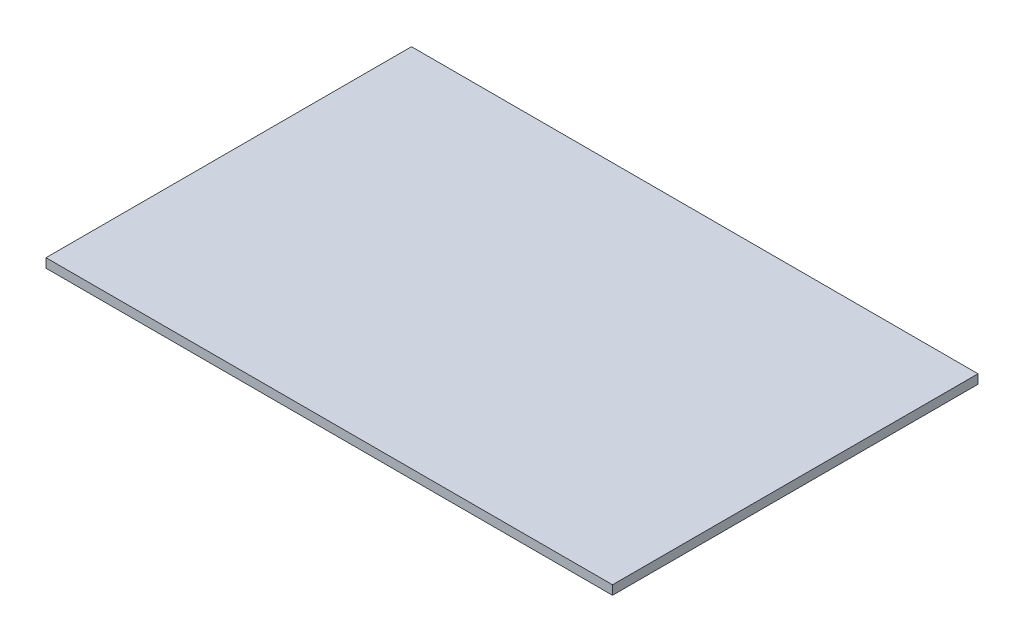
ISO-10303-21;
HEADER;
FILE_DESCRIPTION(('STEP AP214'),'2;1');
FILE_NAME('part.step','',(''),(''),'','','');
FILE_SCHEMA(('AUTOMOTIVE_DESIGN { 1 0 10303 214 1 1 1 1 }'));
ENDSEC;
DATA;
#1=APPLICATION_CONTEXT('core data for automotive mechanical design processes');
#2=APPLICATION_PROTOCOL_DEFINITION('international standard','automotive_design',2000,#1);
#3=PRODUCT_CONTEXT('',#1,'mechanical');
#4=PRODUCT('Part','Part','',(#3));
#5=PRODUCT_RELATED_PRODUCT_CATEGORY('part','',(#4));
#6=PRODUCT_DEFINITION_FORMATION('','',#4);
#7=PRODUCT_DEFINITION_CONTEXT('part definition',#1,'design');
#8=PRODUCT_DEFINITION('design','',#6,#7);
#9=PRODUCT_DEFINITION_SHAPE('','',#8);
#10=(LENGTH_UNIT() NAMED_UNIT(*) SI_UNIT(.MILLI.,.METRE.));
#11=(NAMED_UNIT(*) PLANE_ANGLE_UNIT() SI_UNIT($,.RADIAN.));
#12=(NAMED_UNIT(*) SI_UNIT($,.STERADIAN.) SOLID_ANGLE_UNIT());
#13=UNCERTAINTY_MEASURE_WITH_UNIT(LENGTH_MEASURE(1.E-05),#10,'distance_accuracy_value','');
#14=(GEOMETRIC_REPRESENTATION_CONTEXT(3) GLOBAL_UNCERTAINTY_ASSIGNED_CONTEXT((#13)) GLOBAL_UNIT_ASSIGNED_CONTEXT((#10,
#11,#12)) REPRESENTATION_CONTEXT('',''));
#15=CARTESIAN_POINT('',(0.,0.,0.));
#16=DIRECTION('',(0.,0.,1.));
#17=DIRECTION('',(1.,0.,0.));
#18=AXIS2_PLACEMENT_3D('',#15,#16,#17);
#19=CARTESIAN_POINT('',(-196.85,6.35,-254.));
#20=DIRECTION('',(1.,0.,0.));
#21=DIRECTION('',(0.,0.,-1.));
#22=AXIS2_PLACEMENT_3D('',#19,#20,#21);
#23=PLANE('',#22);
#24=DIRECTION('',(0.,0.,1.));
#25=VECTOR('',#24,1.);
#26=CARTESIAN_POINT('',(-196.85,0.,-254.));
#27=LINE('',#26,#25);
#28=CARTESIAN_POINT('',(-196.85,0.,-254.));
#29=VERTEX_POINT('',#28);
#30=CARTESIAN_POINT('',(-196.85,0.,0.));
#31=VERTEX_POINT('',#30);
#32=EDGE_CURVE('E96',#29,#31,#27,.T.);
#33=ORIENTED_EDGE('',*,*,#32,.T.);
#34=DIRECTION('',(0.,-1.,0.));
#35=VECTOR('',#34,1.);
#36=CARTESIAN_POINT('',(-196.85,6.35,0.));
#37=LINE('',#36,#35);
#38=CARTESIAN_POINT('',(-196.85,6.35,0.));
#39=VERTEX_POINT('',#38);
#40=EDGE_CURVE('E11',#39,#31,#37,.T.);
#41=ORIENTED_EDGE('',*,*,#40,.F.);
#42=DIRECTION('',(0.,0.,1.));
#43=VECTOR('',#42,1.);
#44=CARTESIAN_POINT('',(-196.85,6.35,-254.));
#45=LINE('',#44,#43);
#46=CARTESIAN_POINT('',(-196.85,6.35,-254.));
#47=VERTEX_POINT('',#46);
#48=EDGE_CURVE('E84',#47,#39,#45,.T.);
#49=ORIENTED_EDGE('',*,*,#48,.F.);
#50=DIRECTION('',(0.,-1.,0.));
#51=VECTOR('',#50,1.);
#52=CARTESIAN_POINT('',(-196.85,6.35,-254.));
#53=LINE('',#52,#51);
#54=EDGE_CURVE('E92',#47,#29,#53,.T.);
#55=ORIENTED_EDGE('',*,*,#54,.T.);
#56=EDGE_LOOP('',(#33,#41,#49,#55));
#57=FACE_BOUND('',#56,.T.);
#58=ADVANCED_FACE('F33',(#57),#23,.F.);
#59=CARTESIAN_POINT('',(-196.85,6.35,0.));
#60=DIRECTION('',(0.,0.,-1.));
#61=DIRECTION('',(-1.,0.,0.));
#62=AXIS2_PLACEMENT_3D('',#59,#60,#61);
#63=PLANE('',#62);
#64=DIRECTION('',(1.,0.,0.));
#65=VECTOR('',#64,1.);
#66=CARTESIAN_POINT('',(-196.85,0.,0.));
#67=LINE('',#66,#65);
#68=CARTESIAN_POINT('',(196.85,0.,0.));
#69=VERTEX_POINT('',#68);
#70=EDGE_CURVE('E88',#31,#69,#67,.T.);
#71=ORIENTED_EDGE('',*,*,#70,.T.);
#72=DIRECTION('',(0.,-1.,0.));
#73=VECTOR('',#72,1.);
#74=CARTESIAN_POINT('',(196.85,6.35,0.));
#75=LINE('',#74,#73);
#76=CARTESIAN_POINT('',(196.85,6.35,0.));
#77=VERTEX_POINT('',#76);
#78=EDGE_CURVE('E41',#77,#69,#75,.T.);
#79=ORIENTED_EDGE('',*,*,#78,.F.);
#80=DIRECTION('',(1.,0.,0.));
#81=VECTOR('',#80,1.);
#82=CARTESIAN_POINT('',(-196.85,6.35,0.));
#83=LINE('',#82,#81);
#84=EDGE_CURVE('E79',#39,#77,#83,.T.);
#85=ORIENTED_EDGE('',*,*,#84,.F.);
#86=ORIENTED_EDGE('',*,*,#40,.T.);
#87=EDGE_LOOP('',(#71,#79,#85,#86));
#88=FACE_BOUND('',#87,.T.);
#89=ADVANCED_FACE('F87',(#88),#63,.F.);
#90=CARTESIAN_POINT('',(196.85,6.35,-254.));
#91=DIRECTION('',(-1.,0.,0.));
#92=DIRECTION('',(0.,0.,1.));
#93=AXIS2_PLACEMENT_3D('',#90,#91,#92);
#94=PLANE('',#93);
#95=DIRECTION('',(0.,0.,-1.));
#96=VECTOR('',#95,1.);
#97=CARTESIAN_POINT('',(196.85,0.,-254.));
#98=LINE('',#97,#96);
#99=CARTESIAN_POINT('',(196.85,0.,-254.));
#100=VERTEX_POINT('',#99);
#101=EDGE_CURVE('E66',#69,#100,#98,.T.);
#102=ORIENTED_EDGE('',*,*,#101,.T.);
#103=DIRECTION('',(0.,-1.,0.));
#104=VECTOR('',#103,1.);
#105=CARTESIAN_POINT('',(196.85,6.35,-254.));
#106=LINE('',#105,#104);
#107=CARTESIAN_POINT('',(196.85,6.35,-254.));
#108=VERTEX_POINT('',#107);
#109=EDGE_CURVE('E89',#108,#100,#106,.T.);
#110=ORIENTED_EDGE('',*,*,#109,.F.);
#111=DIRECTION('',(0.,0.,-1.));
#112=VECTOR('',#111,1.);
#113=CARTESIAN_POINT('',(196.85,6.35,-254.));
#114=LINE('',#113,#112);
#115=EDGE_CURVE('E82',#77,#108,#114,.T.);
#116=ORIENTED_EDGE('',*,*,#115,.F.);
#117=ORIENTED_EDGE('',*,*,#78,.T.);
#118=EDGE_LOOP('',(#102,#110,#116,#117));
#119=FACE_BOUND('',#118,.T.);
#120=ADVANCED_FACE('F90',(#119),#94,.F.);
#121=CARTESIAN_POINT('',(-196.85,6.35,-254.));
#122=DIRECTION('',(0.,0.,1.));
#123=DIRECTION('',(1.,0.,0.));
#124=AXIS2_PLACEMENT_3D('',#121,#122,#123);
#125=PLANE('',#124);
#126=DIRECTION('',(-1.,0.,0.));
#127=VECTOR('',#126,1.);
#128=CARTESIAN_POINT('',(-196.85,0.,-254.));
#129=LINE('',#128,#127);
#130=EDGE_CURVE('E72',#100,#29,#129,.T.);
#131=ORIENTED_EDGE('',*,*,#130,.T.);
#132=ORIENTED_EDGE('',*,*,#54,.F.);
#133=DIRECTION('',(-1.,0.,0.));
#134=VECTOR('',#133,1.);
#135=CARTESIAN_POINT('',(-196.85,6.35,-254.));
#136=LINE('',#135,#134);
#137=EDGE_CURVE('E49',#108,#47,#136,.T.);
#138=ORIENTED_EDGE('',*,*,#137,.F.);
#139=ORIENTED_EDGE('',*,*,#109,.T.);
#140=EDGE_LOOP('',(#131,#132,#138,#139));
#141=FACE_BOUND('',#140,.T.);
#142=ADVANCED_FACE('F103',(#141),#125,.F.);
#143=CARTESIAN_POINT('',(0.,6.35,0.));
#144=DIRECTION('',(0.,1.,0.));
#145=DIRECTION('',(0.,0.,1.));
#146=AXIS2_PLACEMENT_3D('',#143,#144,#145);
#147=PLANE('',#146);
#148=ORIENTED_EDGE('',*,*,#48,.T.);
#149=ORIENTED_EDGE('',*,*,#84,.T.);
#150=ORIENTED_EDGE('',*,*,#115,.T.);
#151=ORIENTED_EDGE('',*,*,#137,.T.);
#152=EDGE_LOOP('',(#148,#149,#150,#151));
#153=FACE_BOUND('',#152,.T.);
#154=ADVANCED_FACE('F80',(#153),#147,.T.);
#155=CARTESIAN_POINT('',(0.,0.,0.));
#156=DIRECTION('',(0.,1.,0.));
#157=DIRECTION('',(0.,0.,1.));
#158=AXIS2_PLACEMENT_3D('',#155,#156,#157);
#159=PLANE('',#158);
#160=ORIENTED_EDGE('',*,*,#32,.F.);
#161=ORIENTED_EDGE('',*,*,#130,.F.);
#162=ORIENTED_EDGE('',*,*,#101,.F.);
#163=ORIENTED_EDGE('',*,*,#70,.F.);
#164=EDGE_LOOP('',(#160,#161,#162,#163));
#165=FACE_BOUND('',#164,.T.);
#166=ADVANCED_FACE('F106',(#165),#159,.F.);
#167=CLOSED_SHELL('',(#58,#89,#120,#142,#154,#166));
#168=MANIFOLD_SOLID_BREP('B2',#167);
#169=ADVANCED_BREP_SHAPE_REPRESENTATION('',(#18,#168),#14);
#170=SHAPE_DEFINITION_REPRESENTATION(#9,#169);
ENDSEC;
END-ISO-10303-21;
